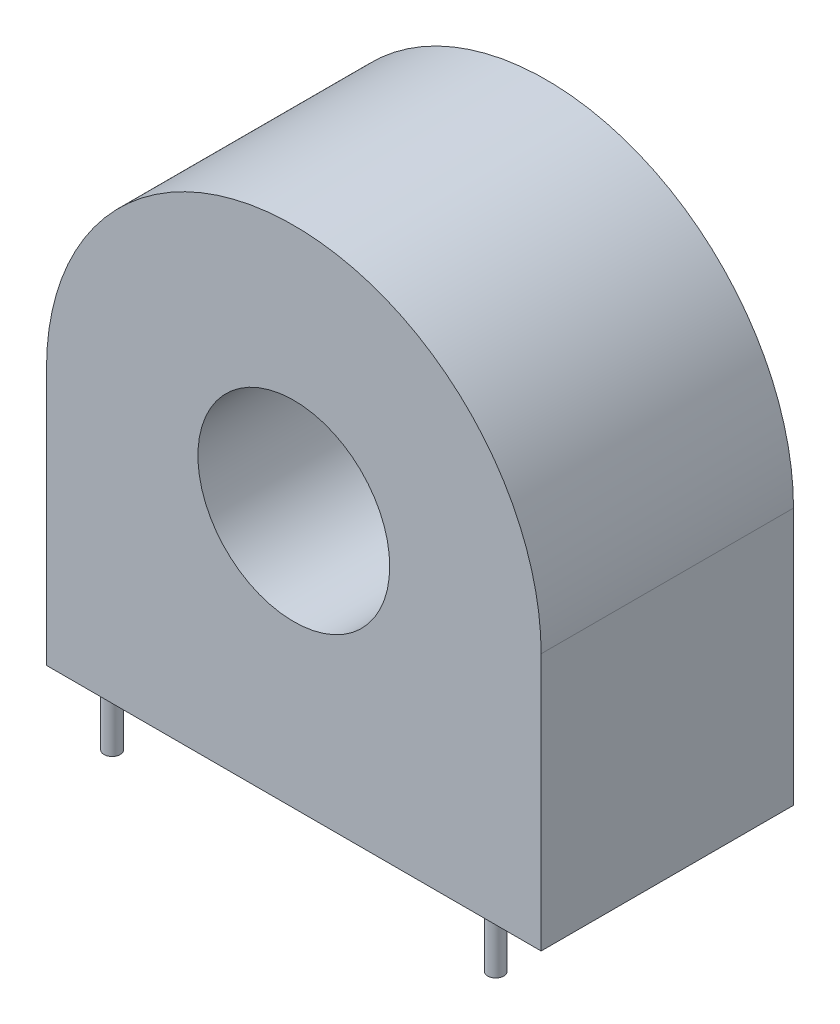
ISO-10303-21;
HEADER;
FILE_DESCRIPTION(('STEP AP214'),'2;1');
FILE_NAME('part.step','',(''),(''),'','','');
FILE_SCHEMA(('AUTOMOTIVE_DESIGN { 1 0 10303 214 1 1 1 1 }'));
ENDSEC;
DATA;
#1=APPLICATION_CONTEXT('core data for automotive mechanical design processes');
#2=APPLICATION_PROTOCOL_DEFINITION('international standard','automotive_design',2000,#1);
#3=PRODUCT_CONTEXT('',#1,'mechanical');
#4=PRODUCT('Part','Part','',(#3));
#5=PRODUCT_RELATED_PRODUCT_CATEGORY('part','',(#4));
#6=PRODUCT_DEFINITION_FORMATION('','',#4);
#7=PRODUCT_DEFINITION_CONTEXT('part definition',#1,'design');
#8=PRODUCT_DEFINITION('design','',#6,#7);
#9=PRODUCT_DEFINITION_SHAPE('','',#8);
#10=(LENGTH_UNIT() NAMED_UNIT(*) SI_UNIT(.MILLI.,.METRE.));
#11=(NAMED_UNIT(*) PLANE_ANGLE_UNIT() SI_UNIT($,.RADIAN.));
#12=(NAMED_UNIT(*) SI_UNIT($,.STERADIAN.) SOLID_ANGLE_UNIT());
#13=UNCERTAINTY_MEASURE_WITH_UNIT(LENGTH_MEASURE(1.E-05),#10,'distance_accuracy_value','');
#14=(GEOMETRIC_REPRESENTATION_CONTEXT(3) GLOBAL_UNCERTAINTY_ASSIGNED_CONTEXT((#13)) GLOBAL_UNIT_ASSIGNED_CONTEXT((#10,
#11,#12)) REPRESENTATION_CONTEXT('',''));
#15=CARTESIAN_POINT('',(0.,0.,0.));
#16=DIRECTION('',(0.,0.,1.));
#17=DIRECTION('',(1.,0.,0.));
#18=AXIS2_PLACEMENT_3D('',#15,#16,#17);
#19=CARTESIAN_POINT('',(0.,6.375,12.5));
#20=DIRECTION('',(0.,0.,1.));
#21=DIRECTION('',(1.,0.,0.));
#22=AXIS2_PLACEMENT_3D('',#19,#20,#21);
#23=PLANE('',#22);
#24=CARTESIAN_POINT('',(0.,6.375,12.5));
#25=DIRECTION('',(0.,0.,1.));
#26=DIRECTION('',(1.,0.,0.));
#27=AXIS2_PLACEMENT_3D('',#24,#25,#26);
#28=CIRCLE('',#27,12.25);
#29=CARTESIAN_POINT('',(12.25,6.375,12.5));
#30=VERTEX_POINT('',#29);
#31=CARTESIAN_POINT('',(-12.25,6.375,12.5));
#32=VERTEX_POINT('',#31);
#33=EDGE_CURVE('E86',#30,#32,#28,.T.);
#34=ORIENTED_EDGE('',*,*,#33,.T.);
#35=DIRECTION('',(0.,-1.,0.));
#36=VECTOR('',#35,1.);
#37=CARTESIAN_POINT('',(-12.25,-6.375,12.5));
#38=LINE('',#37,#36);
#39=CARTESIAN_POINT('',(-12.25,-6.375,12.5));
#40=VERTEX_POINT('',#39);
#41=EDGE_CURVE('E81',#32,#40,#38,.T.);
#42=ORIENTED_EDGE('',*,*,#41,.T.);
#43=DIRECTION('',(1.,0.,0.));
#44=VECTOR('',#43,1.);
#45=CARTESIAN_POINT('',(12.25,-6.375,12.5));
#46=LINE('',#45,#44);
#47=CARTESIAN_POINT('',(12.25,-6.375,12.5));
#48=VERTEX_POINT('',#47);
#49=EDGE_CURVE('E84',#40,#48,#46,.T.);
#50=ORIENTED_EDGE('',*,*,#49,.T.);
#51=DIRECTION('',(0.,1.,0.));
#52=VECTOR('',#51,1.);
#53=CARTESIAN_POINT('',(12.25,-6.375,12.5));
#54=LINE('',#53,#52);
#55=EDGE_CURVE('E50',#48,#30,#54,.T.);
#56=ORIENTED_EDGE('',*,*,#55,.T.);
#57=EDGE_LOOP('',(#34,#42,#50,#56));
#58=FACE_BOUND('',#57,.T.);
#59=CARTESIAN_POINT('',(0.,6.375,12.5));
#60=DIRECTION('',(0.,0.,1.));
#61=DIRECTION('',(1.,0.,0.));
#62=AXIS2_PLACEMENT_3D('',#59,#60,#61);
#63=CIRCLE('',#62,4.75);
#64=CARTESIAN_POINT('',(4.75,6.375,12.5));
#65=VERTEX_POINT('',#64);
#66=EDGE_CURVE('E104',#65,#65,#63,.T.);
#67=ORIENTED_EDGE('',*,*,#66,.F.);
#68=EDGE_LOOP('',(#67));
#69=FACE_BOUND('',#68,.T.);
#70=ADVANCED_FACE('F33',(#58,#69),#23,.T.);
#71=CARTESIAN_POINT('',(0.,6.375,0.));
#72=DIRECTION('',(0.,0.,1.));
#73=DIRECTION('',(1.,0.,0.));
#74=AXIS2_PLACEMENT_3D('',#71,#72,#73);
#75=PLANE('',#74);
#76=CARTESIAN_POINT('',(0.,6.375,0.));
#77=DIRECTION('',(0.,0.,1.));
#78=DIRECTION('',(1.,0.,0.));
#79=AXIS2_PLACEMENT_3D('',#76,#77,#78);
#80=CIRCLE('',#79,12.25);
#81=CARTESIAN_POINT('',(12.25,6.375,0.));
#82=VERTEX_POINT('',#81);
#83=CARTESIAN_POINT('',(-12.25,6.375,0.));
#84=VERTEX_POINT('',#83);
#85=EDGE_CURVE('E101',#82,#84,#80,.T.);
#86=ORIENTED_EDGE('',*,*,#85,.F.);
#87=DIRECTION('',(0.,1.,0.));
#88=VECTOR('',#87,1.);
#89=CARTESIAN_POINT('',(12.25,-6.375,0.));
#90=LINE('',#89,#88);
#91=CARTESIAN_POINT('',(12.25,-6.375,0.));
#92=VERTEX_POINT('',#91);
#93=EDGE_CURVE('E73',#92,#82,#90,.T.);
#94=ORIENTED_EDGE('',*,*,#93,.F.);
#95=DIRECTION('',(1.,0.,0.));
#96=VECTOR('',#95,1.);
#97=CARTESIAN_POINT('',(12.25,-6.375,0.));
#98=LINE('',#97,#96);
#99=CARTESIAN_POINT('',(-12.25,-6.375,0.));
#100=VERTEX_POINT('',#99);
#101=EDGE_CURVE('E67',#100,#92,#98,.T.);
#102=ORIENTED_EDGE('',*,*,#101,.F.);
#103=DIRECTION('',(0.,-1.,0.));
#104=VECTOR('',#103,1.);
#105=CARTESIAN_POINT('',(-12.25,-6.375,0.));
#106=LINE('',#105,#104);
#107=EDGE_CURVE('E91',#84,#100,#106,.T.);
#108=ORIENTED_EDGE('',*,*,#107,.F.);
#109=EDGE_LOOP('',(#86,#94,#102,#108));
#110=FACE_BOUND('',#109,.T.);
#111=CARTESIAN_POINT('',(0.,6.375,0.));
#112=DIRECTION('',(0.,0.,1.));
#113=DIRECTION('',(1.,0.,0.));
#114=AXIS2_PLACEMENT_3D('',#111,#112,#113);
#115=CIRCLE('',#114,4.75);
#116=CARTESIAN_POINT('',(4.75,6.375,0.));
#117=VERTEX_POINT('',#116);
#118=EDGE_CURVE('E167',#117,#117,#115,.T.);
#119=ORIENTED_EDGE('',*,*,#118,.T.);
#120=EDGE_LOOP('',(#119));
#121=FACE_BOUND('',#120,.T.);
#122=ADVANCED_FACE('F147',(#110,#121),#75,.F.);
#123=CARTESIAN_POINT('',(0.,6.375,12.5));
#124=DIRECTION('',(0.,0.,-1.));
#125=DIRECTION('',(-1.,0.,0.));
#126=AXIS2_PLACEMENT_3D('',#123,#124,#125);
#127=CYLINDRICAL_SURFACE('',#126,12.25);
#128=ORIENTED_EDGE('',*,*,#85,.T.);
#129=DIRECTION('',(0.,0.,-1.));
#130=VECTOR('',#129,1.);
#131=CARTESIAN_POINT('',(-12.25,6.375,12.5));
#132=LINE('',#131,#130);
#133=EDGE_CURVE('E92',#32,#84,#132,.T.);
#134=ORIENTED_EDGE('',*,*,#133,.F.);
#135=ORIENTED_EDGE('',*,*,#33,.F.);
#136=DIRECTION('',(0.,0.,-1.));
#137=VECTOR('',#136,1.);
#138=CARTESIAN_POINT('',(12.25,6.375,12.5));
#139=LINE('',#138,#137);
#140=EDGE_CURVE('E97',#30,#82,#139,.T.);
#141=ORIENTED_EDGE('',*,*,#140,.T.);
#142=EDGE_LOOP('',(#128,#134,#135,#141));
#143=FACE_BOUND('',#142,.T.);
#144=ADVANCED_FACE('F35',(#143),#127,.T.);
#145=CARTESIAN_POINT('',(-12.25,-6.375,12.5));
#146=DIRECTION('',(1.,0.,0.));
#147=DIRECTION('',(0.,1.,0.));
#148=AXIS2_PLACEMENT_3D('',#145,#146,#147);
#149=PLANE('',#148);
#150=ORIENTED_EDGE('',*,*,#107,.T.);
#151=DIRECTION('',(0.,0.,-1.));
#152=VECTOR('',#151,1.);
#153=CARTESIAN_POINT('',(-12.25,-6.375,12.5));
#154=LINE('',#153,#152);
#155=EDGE_CURVE('E89',#40,#100,#154,.T.);
#156=ORIENTED_EDGE('',*,*,#155,.F.);
#157=ORIENTED_EDGE('',*,*,#41,.F.);
#158=ORIENTED_EDGE('',*,*,#133,.T.);
#159=EDGE_LOOP('',(#150,#156,#157,#158));
#160=FACE_BOUND('',#159,.T.);
#161=ADVANCED_FACE('F90',(#160),#149,.F.);
#162=CARTESIAN_POINT('',(12.25,-6.375,12.5));
#163=DIRECTION('',(0.,1.,0.));
#164=DIRECTION('',(-1.,0.,0.));
#165=AXIS2_PLACEMENT_3D('',#162,#163,#164);
#166=PLANE('',#165);
#167=CARTESIAN_POINT('',(-9.5,-6.375,12.));
#168=DIRECTION('',(0.,1.,0.));
#169=DIRECTION('',(-1.,0.,0.));
#170=AXIS2_PLACEMENT_3D('',#167,#168,#169);
#171=CIRCLE('',#170,0.399999999999999);
#172=CARTESIAN_POINT('',(-9.9,-6.375,12.));
#173=VERTEX_POINT('',#172);
#174=EDGE_CURVE('E11',#173,#173,#171,.F.);
#175=ORIENTED_EDGE('',*,*,#174,.F.);
#176=EDGE_LOOP('',(#175));
#177=FACE_BOUND('',#176,.T.);
#178=CARTESIAN_POINT('',(9.5,-6.375,12.));
#179=DIRECTION('',(0.,1.,0.));
#180=DIRECTION('',(-1.,0.,0.));
#181=AXIS2_PLACEMENT_3D('',#178,#179,#180);
#182=CIRCLE('',#181,0.399999999999999);
#183=CARTESIAN_POINT('',(9.1,-6.375,12.));
#184=VERTEX_POINT('',#183);
#185=EDGE_CURVE('E42',#184,#184,#182,.F.);
#186=ORIENTED_EDGE('',*,*,#185,.F.);
#187=EDGE_LOOP('',(#186));
#188=FACE_BOUND('',#187,.T.);
#189=CARTESIAN_POINT('',(-7.4,-6.375,0.499999999999945));
#190=DIRECTION('',(0.,1.,0.));
#191=DIRECTION('',(-1.,0.,0.));
#192=AXIS2_PLACEMENT_3D('',#189,#190,#191);
#193=CIRCLE('',#192,0.4);
#194=CARTESIAN_POINT('',(-7.8,-6.375,0.499999999999945));
#195=VERTEX_POINT('',#194);
#196=EDGE_CURVE('E114',#195,#195,#193,.F.);
#197=ORIENTED_EDGE('',*,*,#196,.F.);
#198=EDGE_LOOP('',(#197));
#199=FACE_BOUND('',#198,.T.);
#200=CARTESIAN_POINT('',(7.4,-6.375,0.499999999999945));
#201=DIRECTION('',(0.,1.,0.));
#202=DIRECTION('',(-1.,0.,0.));
#203=AXIS2_PLACEMENT_3D('',#200,#201,#202);
#204=CIRCLE('',#203,0.4);
#205=CARTESIAN_POINT('',(7.,-6.375,0.499999999999945));
#206=VERTEX_POINT('',#205);
#207=EDGE_CURVE('E111',#206,#206,#204,.F.);
#208=ORIENTED_EDGE('',*,*,#207,.F.);
#209=EDGE_LOOP('',(#208));
#210=FACE_BOUND('',#209,.T.);
#211=ORIENTED_EDGE('',*,*,#101,.T.);
#212=DIRECTION('',(0.,0.,-1.));
#213=VECTOR('',#212,1.);
#214=CARTESIAN_POINT('',(12.25,-6.375,12.5));
#215=LINE('',#214,#213);
#216=EDGE_CURVE('E93',#48,#92,#215,.T.);
#217=ORIENTED_EDGE('',*,*,#216,.F.);
#218=ORIENTED_EDGE('',*,*,#49,.F.);
#219=ORIENTED_EDGE('',*,*,#155,.T.);
#220=EDGE_LOOP('',(#211,#217,#218,#219));
#221=FACE_BOUND('',#220,.T.);
#222=ADVANCED_FACE('F95',(#177,#188,#199,#210,#221),#166,.F.);
#223=CARTESIAN_POINT('',(12.25,-6.375,12.5));
#224=DIRECTION('',(-1.,0.,0.));
#225=DIRECTION('',(0.,0.,1.));
#226=AXIS2_PLACEMENT_3D('',#223,#224,#225);
#227=PLANE('',#226);
#228=ORIENTED_EDGE('',*,*,#93,.T.);
#229=ORIENTED_EDGE('',*,*,#140,.F.);
#230=ORIENTED_EDGE('',*,*,#55,.F.);
#231=ORIENTED_EDGE('',*,*,#216,.T.);
#232=EDGE_LOOP('',(#228,#229,#230,#231));
#233=FACE_BOUND('',#232,.T.);
#234=ADVANCED_FACE('F123',(#233),#227,.F.);
#235=CARTESIAN_POINT('',(0.,6.375,12.5));
#236=DIRECTION('',(0.,0.,-1.));
#237=DIRECTION('',(-1.,0.,0.));
#238=AXIS2_PLACEMENT_3D('',#235,#236,#237);
#239=CYLINDRICAL_SURFACE('',#238,4.75);
#240=ORIENTED_EDGE('',*,*,#66,.T.);
#241=EDGE_LOOP('',(#240));
#242=FACE_BOUND('',#241,.T.);
#243=ORIENTED_EDGE('',*,*,#118,.F.);
#244=EDGE_LOOP('',(#243));
#245=FACE_BOUND('',#244,.T.);
#246=ADVANCED_FACE('F133',(#242,#245),#239,.F.);
#247=CARTESIAN_POINT('',(7.4,-8.875,0.499999999999945));
#248=DIRECTION('',(0.,1.,0.));
#249=DIRECTION('',(-1.,0.,0.));
#250=AXIS2_PLACEMENT_3D('',#247,#248,#249);
#251=CYLINDRICAL_SURFACE('',#250,0.4);
#252=CARTESIAN_POINT('',(7.4,-8.875,0.499999999999945));
#253=DIRECTION('',(0.,-1.,0.));
#254=DIRECTION('',(1.,0.,0.));
#255=AXIS2_PLACEMENT_3D('',#252,#253,#254);
#256=CIRCLE('',#255,0.4);
#257=CARTESIAN_POINT('',(7.8,-8.875,0.499999999999945));
#258=VERTEX_POINT('',#257);
#259=EDGE_CURVE('E169',#258,#258,#256,.T.);
#260=ORIENTED_EDGE('',*,*,#259,.F.);
#261=EDGE_LOOP('',(#260));
#262=FACE_BOUND('',#261,.T.);
#263=ORIENTED_EDGE('',*,*,#207,.T.);
#264=EDGE_LOOP('',(#263));
#265=FACE_BOUND('',#264,.T.);
#266=ADVANCED_FACE('F130',(#262,#265),#251,.T.);
#267=CARTESIAN_POINT('',(7.4,-8.875,0.499999999999945));
#268=DIRECTION('',(0.,-1.,0.));
#269=DIRECTION('',(1.,0.,0.));
#270=AXIS2_PLACEMENT_3D('',#267,#268,#269);
#271=PLANE('',#270);
#272=ORIENTED_EDGE('',*,*,#259,.T.);
#273=EDGE_LOOP('',(#272));
#274=FACE_BOUND('',#273,.T.);
#275=ADVANCED_FACE('F132',(#274),#271,.T.);
#276=CARTESIAN_POINT('',(-7.4,-8.875,0.499999999999945));
#277=DIRECTION('',(0.,1.,0.));
#278=DIRECTION('',(-1.,0.,0.));
#279=AXIS2_PLACEMENT_3D('',#276,#277,#278);
#280=CYLINDRICAL_SURFACE('',#279,0.4);
#281=CARTESIAN_POINT('',(-7.4,-8.875,0.499999999999945));
#282=DIRECTION('',(0.,-1.,0.));
#283=DIRECTION('',(1.,0.,0.));
#284=AXIS2_PLACEMENT_3D('',#281,#282,#283);
#285=CIRCLE('',#284,0.4);
#286=CARTESIAN_POINT('',(-7.,-8.875,0.499999999999945));
#287=VERTEX_POINT('',#286);
#288=EDGE_CURVE('E174',#287,#287,#285,.T.);
#289=ORIENTED_EDGE('',*,*,#288,.F.);
#290=EDGE_LOOP('',(#289));
#291=FACE_BOUND('',#290,.T.);
#292=ORIENTED_EDGE('',*,*,#196,.T.);
#293=EDGE_LOOP('',(#292));
#294=FACE_BOUND('',#293,.T.);
#295=ADVANCED_FACE('F140',(#291,#294),#280,.T.);
#296=CARTESIAN_POINT('',(-7.4,-8.875,0.499999999999945));
#297=DIRECTION('',(0.,-1.,0.));
#298=DIRECTION('',(1.,0.,0.));
#299=AXIS2_PLACEMENT_3D('',#296,#297,#298);
#300=PLANE('',#299);
#301=ORIENTED_EDGE('',*,*,#288,.T.);
#302=EDGE_LOOP('',(#301));
#303=FACE_BOUND('',#302,.T.);
#304=ADVANCED_FACE('F204',(#303),#300,.T.);
#305=CARTESIAN_POINT('',(9.5,-8.875,12.));
#306=DIRECTION('',(0.,1.,0.));
#307=DIRECTION('',(-1.,0.,0.));
#308=AXIS2_PLACEMENT_3D('',#305,#306,#307);
#309=CYLINDRICAL_SURFACE('',#308,0.399999999999999);
#310=CARTESIAN_POINT('',(9.5,-8.875,12.));
#311=DIRECTION('',(0.,-1.,0.));
#312=DIRECTION('',(1.,0.,0.));
#313=AXIS2_PLACEMENT_3D('',#310,#311,#312);
#314=CIRCLE('',#313,0.399999999999999);
#315=CARTESIAN_POINT('',(9.9,-8.875,12.));
#316=VERTEX_POINT('',#315);
#317=EDGE_CURVE('E179',#316,#316,#314,.T.);
#318=ORIENTED_EDGE('',*,*,#317,.F.);
#319=EDGE_LOOP('',(#318));
#320=FACE_BOUND('',#319,.T.);
#321=ORIENTED_EDGE('',*,*,#185,.T.);
#322=EDGE_LOOP('',(#321));
#323=FACE_BOUND('',#322,.T.);
#324=ADVANCED_FACE('F119',(#320,#323),#309,.T.);
#325=CARTESIAN_POINT('',(9.5,-8.875,12.));
#326=DIRECTION('',(0.,-1.,0.));
#327=DIRECTION('',(1.,0.,0.));
#328=AXIS2_PLACEMENT_3D('',#325,#326,#327);
#329=PLANE('',#328);
#330=ORIENTED_EDGE('',*,*,#317,.T.);
#331=EDGE_LOOP('',(#330));
#332=FACE_BOUND('',#331,.T.);
#333=ADVANCED_FACE('F191',(#332),#329,.T.);
#334=CARTESIAN_POINT('',(-9.5,-8.875,12.));
#335=DIRECTION('',(0.,1.,0.));
#336=DIRECTION('',(-1.,0.,0.));
#337=AXIS2_PLACEMENT_3D('',#334,#335,#336);
#338=CYLINDRICAL_SURFACE('',#337,0.399999999999999);
#339=CARTESIAN_POINT('',(-9.5,-8.875,12.));
#340=DIRECTION('',(0.,-1.,0.));
#341=DIRECTION('',(1.,0.,0.));
#342=AXIS2_PLACEMENT_3D('',#339,#340,#341);
#343=CIRCLE('',#342,0.399999999999999);
#344=CARTESIAN_POINT('',(-9.1,-8.875,12.));
#345=VERTEX_POINT('',#344);
#346=EDGE_CURVE('E182',#345,#345,#343,.T.);
#347=ORIENTED_EDGE('',*,*,#346,.F.);
#348=EDGE_LOOP('',(#347));
#349=FACE_BOUND('',#348,.T.);
#350=ORIENTED_EDGE('',*,*,#174,.T.);
#351=EDGE_LOOP('',(#350));
#352=FACE_BOUND('',#351,.T.);
#353=ADVANCED_FACE('F188',(#349,#352),#338,.T.);
#354=CARTESIAN_POINT('',(-9.5,-8.875,12.));
#355=DIRECTION('',(0.,-1.,0.));
#356=DIRECTION('',(1.,0.,0.));
#357=AXIS2_PLACEMENT_3D('',#354,#355,#356);
#358=PLANE('',#357);
#359=ORIENTED_EDGE('',*,*,#346,.T.);
#360=EDGE_LOOP('',(#359));
#361=FACE_BOUND('',#360,.T.);
#362=ADVANCED_FACE('F186',(#361),#358,.T.);
#363=CLOSED_SHELL('',(#70,#122,#144,#161,#222,#234,#246,#266,#275,#295,#304,#324,#333,#353,#362));
#364=MANIFOLD_SOLID_BREP('B2',#363);
#365=ADVANCED_BREP_SHAPE_REPRESENTATION('',(#18,#364),#14);
#366=SHAPE_DEFINITION_REPRESENTATION(#9,#365);
ENDSEC;
END-ISO-10303-21;
